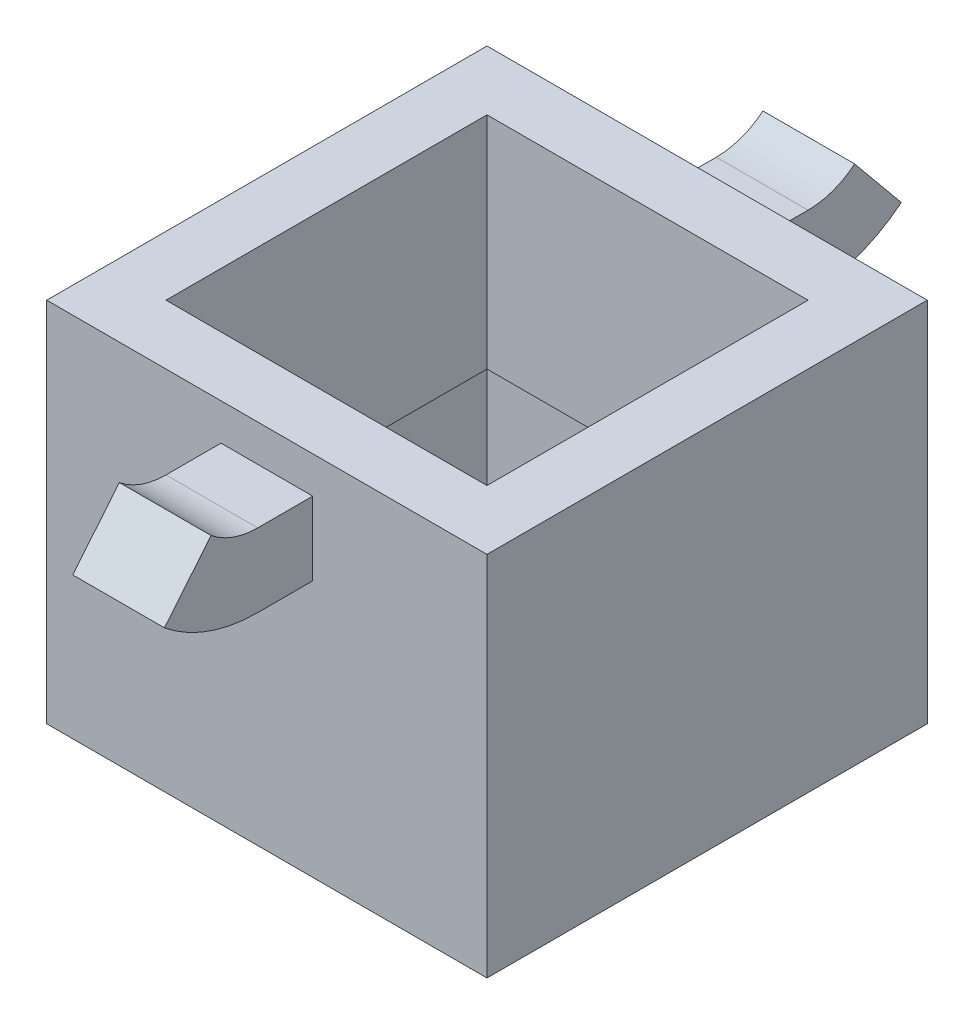
ISO-10303-21;
HEADER;
FILE_DESCRIPTION(('STEP AP214'),'2;1');
FILE_NAME('part.step','',(''),(''),'','','');
FILE_SCHEMA(('AUTOMOTIVE_DESIGN { 1 0 10303 214 1 1 1 1 }'));
ENDSEC;
DATA;
#1=APPLICATION_CONTEXT('core data for automotive mechanical design processes');
#2=APPLICATION_PROTOCOL_DEFINITION('international standard','automotive_design',2000,#1);
#3=PRODUCT_CONTEXT('',#1,'mechanical');
#4=PRODUCT('Part','Part','',(#3));
#5=PRODUCT_RELATED_PRODUCT_CATEGORY('part','',(#4));
#6=PRODUCT_DEFINITION_FORMATION('','',#4);
#7=PRODUCT_DEFINITION_CONTEXT('part definition',#1,'design');
#8=PRODUCT_DEFINITION('design','',#6,#7);
#9=PRODUCT_DEFINITION_SHAPE('','',#8);
#10=(LENGTH_UNIT() NAMED_UNIT(*) SI_UNIT(.MILLI.,.METRE.));
#11=(NAMED_UNIT(*) PLANE_ANGLE_UNIT() SI_UNIT($,.RADIAN.));
#12=(NAMED_UNIT(*) SI_UNIT($,.STERADIAN.) SOLID_ANGLE_UNIT());
#13=UNCERTAINTY_MEASURE_WITH_UNIT(LENGTH_MEASURE(1.E-05),#10,'distance_accuracy_value','');
#14=(GEOMETRIC_REPRESENTATION_CONTEXT(3) GLOBAL_UNCERTAINTY_ASSIGNED_CONTEXT((#13)) GLOBAL_UNIT_ASSIGNED_CONTEXT((#10,
#11,#12)) REPRESENTATION_CONTEXT('',''));
#15=CARTESIAN_POINT('',(0.,0.,0.));
#16=DIRECTION('',(0.,0.,1.));
#17=DIRECTION('',(1.,0.,0.));
#18=AXIS2_PLACEMENT_3D('',#15,#16,#17);
#19=CARTESIAN_POINT('',(12.,20.,-12.));
#20=DIRECTION('',(0.,0.,1.));
#21=DIRECTION('',(1.,0.,0.));
#22=AXIS2_PLACEMENT_3D('',#19,#20,#21);
#23=PLANE('',#22);
#24=DIRECTION('',(-1.,0.,0.));
#25=VECTOR('',#24,1.);
#26=CARTESIAN_POINT('',(12.,0.,-12.));
#27=LINE('',#26,#25);
#28=CARTESIAN_POINT('',(12.,0.,-12.));
#29=VERTEX_POINT('',#28);
#30=CARTESIAN_POINT('',(-12.,0.,-12.));
#31=VERTEX_POINT('',#30);
#32=EDGE_CURVE('E366',#29,#31,#27,.T.);
#33=ORIENTED_EDGE('',*,*,#32,.T.);
#34=DIRECTION('',(0.,-1.,0.));
#35=VECTOR('',#34,1.);
#36=CARTESIAN_POINT('',(-12.,20.,-12.));
#37=LINE('',#36,#35);
#38=CARTESIAN_POINT('',(-12.,20.,-12.));
#39=VERTEX_POINT('',#38);
#40=EDGE_CURVE('E372',#39,#31,#37,.T.);
#41=ORIENTED_EDGE('',*,*,#40,.F.);
#42=DIRECTION('',(-1.,0.,0.));
#43=VECTOR('',#42,1.);
#44=CARTESIAN_POINT('',(12.,20.,-12.));
#45=LINE('',#44,#43);
#46=CARTESIAN_POINT('',(12.,20.,-12.));
#47=VERTEX_POINT('',#46);
#48=EDGE_CURVE('E370',#47,#39,#45,.T.);
#49=ORIENTED_EDGE('',*,*,#48,.F.);
#50=DIRECTION('',(0.,-1.,0.));
#51=VECTOR('',#50,1.);
#52=CARTESIAN_POINT('',(12.,20.,-12.));
#53=LINE('',#52,#51);
#54=EDGE_CURVE('E382',#47,#29,#53,.T.);
#55=ORIENTED_EDGE('',*,*,#54,.T.);
#56=EDGE_LOOP('',(#33,#41,#49,#55));
#57=FACE_BOUND('',#56,.T.);
#58=DIRECTION('',(0.,-1.,0.));
#59=VECTOR('',#58,1.);
#60=CARTESIAN_POINT('',(2.50000000000001,18.,-12.));
#61=LINE('',#60,#59);
#62=CARTESIAN_POINT('',(2.50000000000001,18.,-12.));
#63=VERTEX_POINT('',#62);
#64=CARTESIAN_POINT('',(2.50000000000001,14.,-12.));
#65=VERTEX_POINT('',#64);
#66=EDGE_CURVE('E307',#63,#65,#61,.T.);
#67=ORIENTED_EDGE('',*,*,#66,.F.);
#68=DIRECTION('',(1.,0.,0.));
#69=VECTOR('',#68,1.);
#70=CARTESIAN_POINT('',(-2.49999999999999,18.,-12.));
#71=LINE('',#70,#69);
#72=CARTESIAN_POINT('',(-2.5,18.,-12.));
#73=VERTEX_POINT('',#72);
#74=EDGE_CURVE('E312',#73,#63,#71,.T.);
#75=ORIENTED_EDGE('',*,*,#74,.F.);
#76=DIRECTION('',(0.,1.,0.));
#77=VECTOR('',#76,1.);
#78=CARTESIAN_POINT('',(-2.49999999999999,18.,-12.));
#79=LINE('',#78,#77);
#80=CARTESIAN_POINT('',(-2.5,14.,-12.));
#81=VERTEX_POINT('',#80);
#82=EDGE_CURVE('E321',#81,#73,#79,.T.);
#83=ORIENTED_EDGE('',*,*,#82,.F.);
#84=DIRECTION('',(-1.,0.,0.));
#85=VECTOR('',#84,1.);
#86=CARTESIAN_POINT('',(-2.49999999999999,14.,-12.));
#87=LINE('',#86,#85);
#88=EDGE_CURVE('E318',#65,#81,#87,.T.);
#89=ORIENTED_EDGE('',*,*,#88,.F.);
#90=EDGE_LOOP('',(#67,#75,#83,#89));
#91=FACE_BOUND('',#90,.T.);
#92=ADVANCED_FACE('F33',(#57,#91),#23,.F.);
#93=CARTESIAN_POINT('',(-12.,20.,12.));
#94=DIRECTION('',(1.,0.,0.));
#95=DIRECTION('',(0.,0.,-1.));
#96=AXIS2_PLACEMENT_3D('',#93,#94,#95);
#97=PLANE('',#96);
#98=DIRECTION('',(0.,0.,1.));
#99=VECTOR('',#98,1.);
#100=CARTESIAN_POINT('',(-12.,0.,12.));
#101=LINE('',#100,#99);
#102=CARTESIAN_POINT('',(-12.,0.,12.));
#103=VERTEX_POINT('',#102);
#104=EDGE_CURVE('E361',#31,#103,#101,.T.);
#105=ORIENTED_EDGE('',*,*,#104,.T.);
#106=DIRECTION('',(0.,-1.,0.));
#107=VECTOR('',#106,1.);
#108=CARTESIAN_POINT('',(-12.,20.,12.));
#109=LINE('',#108,#107);
#110=CARTESIAN_POINT('',(-12.,20.,12.));
#111=VERTEX_POINT('',#110);
#112=EDGE_CURVE('E11',#111,#103,#109,.T.);
#113=ORIENTED_EDGE('',*,*,#112,.F.);
#114=DIRECTION('',(0.,0.,1.));
#115=VECTOR('',#114,1.);
#116=CARTESIAN_POINT('',(-12.,20.,12.));
#117=LINE('',#116,#115);
#118=EDGE_CURVE('E362',#39,#111,#117,.T.);
#119=ORIENTED_EDGE('',*,*,#118,.F.);
#120=ORIENTED_EDGE('',*,*,#40,.T.);
#121=EDGE_LOOP('',(#105,#113,#119,#120));
#122=FACE_BOUND('',#121,.T.);
#123=ADVANCED_FACE('F35',(#122),#97,.F.);
#124=CARTESIAN_POINT('',(12.,20.,12.));
#125=DIRECTION('',(0.,0.,-1.));
#126=DIRECTION('',(-1.,0.,0.));
#127=AXIS2_PLACEMENT_3D('',#124,#125,#126);
#128=PLANE('',#127);
#129=DIRECTION('',(1.,0.,0.));
#130=VECTOR('',#129,1.);
#131=CARTESIAN_POINT('',(-2.49999999999999,18.,12.));
#132=LINE('',#131,#130);
#133=CARTESIAN_POINT('',(-2.49999999999999,18.,12.));
#134=VERTEX_POINT('',#133);
#135=CARTESIAN_POINT('',(2.50000000000001,18.,12.));
#136=VERTEX_POINT('',#135);
#137=EDGE_CURVE('E271',#134,#136,#132,.T.);
#138=ORIENTED_EDGE('',*,*,#137,.T.);
#139=DIRECTION('',(0.,-1.,0.));
#140=VECTOR('',#139,1.);
#141=CARTESIAN_POINT('',(2.50000000000001,18.,12.));
#142=LINE('',#141,#140);
#143=CARTESIAN_POINT('',(2.5,14.,12.));
#144=VERTEX_POINT('',#143);
#145=EDGE_CURVE('E254',#136,#144,#142,.T.);
#146=ORIENTED_EDGE('',*,*,#145,.T.);
#147=DIRECTION('',(-1.,0.,0.));
#148=VECTOR('',#147,1.);
#149=CARTESIAN_POINT('',(-2.49999999999999,14.,12.));
#150=LINE('',#149,#148);
#151=CARTESIAN_POINT('',(-2.5,14.,12.));
#152=VERTEX_POINT('',#151);
#153=EDGE_CURVE('E265',#144,#152,#150,.T.);
#154=ORIENTED_EDGE('',*,*,#153,.T.);
#155=DIRECTION('',(0.,1.,0.));
#156=VECTOR('',#155,1.);
#157=CARTESIAN_POINT('',(-2.49999999999999,18.,12.));
#158=LINE('',#157,#156);
#159=EDGE_CURVE('E274',#152,#134,#158,.T.);
#160=ORIENTED_EDGE('',*,*,#159,.T.);
#161=EDGE_LOOP('',(#138,#146,#154,#160));
#162=FACE_BOUND('',#161,.T.);
#163=DIRECTION('',(1.,0.,0.));
#164=VECTOR('',#163,1.);
#165=CARTESIAN_POINT('',(12.,0.,12.));
#166=LINE('',#165,#164);
#167=CARTESIAN_POINT('',(12.,0.,12.));
#168=VERTEX_POINT('',#167);
#169=EDGE_CURVE('E375',#103,#168,#166,.T.);
#170=ORIENTED_EDGE('',*,*,#169,.T.);
#171=DIRECTION('',(0.,-1.,0.));
#172=VECTOR('',#171,1.);
#173=CARTESIAN_POINT('',(12.,20.,12.));
#174=LINE('',#173,#172);
#175=CARTESIAN_POINT('',(12.,20.,12.));
#176=VERTEX_POINT('',#175);
#177=EDGE_CURVE('E41',#176,#168,#174,.T.);
#178=ORIENTED_EDGE('',*,*,#177,.F.);
#179=DIRECTION('',(1.,0.,0.));
#180=VECTOR('',#179,1.);
#181=CARTESIAN_POINT('',(12.,20.,12.));
#182=LINE('',#181,#180);
#183=EDGE_CURVE('E365',#111,#176,#182,.T.);
#184=ORIENTED_EDGE('',*,*,#183,.F.);
#185=ORIENTED_EDGE('',*,*,#112,.T.);
#186=EDGE_LOOP('',(#170,#178,#184,#185));
#187=FACE_BOUND('',#186,.T.);
#188=ADVANCED_FACE('F403',(#162,#187),#128,.F.);
#189=CARTESIAN_POINT('',(12.,20.,12.));
#190=DIRECTION('',(-1.,0.,0.));
#191=DIRECTION('',(0.,0.,1.));
#192=AXIS2_PLACEMENT_3D('',#189,#190,#191);
#193=PLANE('',#192);
#194=DIRECTION('',(0.,0.,-1.));
#195=VECTOR('',#194,1.);
#196=CARTESIAN_POINT('',(12.,0.,12.));
#197=LINE('',#196,#195);
#198=EDGE_CURVE('E377',#168,#29,#197,.T.);
#199=ORIENTED_EDGE('',*,*,#198,.T.);
#200=ORIENTED_EDGE('',*,*,#54,.F.);
#201=DIRECTION('',(0.,0.,-1.));
#202=VECTOR('',#201,1.);
#203=CARTESIAN_POINT('',(12.,20.,12.));
#204=LINE('',#203,#202);
#205=EDGE_CURVE('E368',#176,#47,#204,.T.);
#206=ORIENTED_EDGE('',*,*,#205,.F.);
#207=ORIENTED_EDGE('',*,*,#177,.T.);
#208=EDGE_LOOP('',(#199,#200,#206,#207));
#209=FACE_BOUND('',#208,.T.);
#210=ADVANCED_FACE('F389',(#209),#193,.F.);
#211=CARTESIAN_POINT('',(0.,20.,0.));
#212=DIRECTION('',(0.,1.,0.));
#213=DIRECTION('',(0.,0.,1.));
#214=AXIS2_PLACEMENT_3D('',#211,#212,#213);
#215=PLANE('',#214);
#216=DIRECTION('',(0.,0.,-1.));
#217=VECTOR('',#216,1.);
#218=CARTESIAN_POINT('',(-8.75,20.,-8.75));
#219=LINE('',#218,#217);
#220=CARTESIAN_POINT('',(-8.75,20.,8.75));
#221=VERTEX_POINT('',#220);
#222=CARTESIAN_POINT('',(-8.75,20.,-8.75));
#223=VERTEX_POINT('',#222);
#224=EDGE_CURVE('E204',#221,#223,#219,.T.);
#225=ORIENTED_EDGE('',*,*,#224,.T.);
#226=DIRECTION('',(1.,0.,0.));
#227=VECTOR('',#226,1.);
#228=CARTESIAN_POINT('',(8.75,20.,-8.75));
#229=LINE('',#228,#227);
#230=CARTESIAN_POINT('',(8.75,20.,-8.75));
#231=VERTEX_POINT('',#230);
#232=EDGE_CURVE('E193',#223,#231,#229,.T.);
#233=ORIENTED_EDGE('',*,*,#232,.T.);
#234=DIRECTION('',(0.,0.,1.));
#235=VECTOR('',#234,1.);
#236=CARTESIAN_POINT('',(8.75,20.,-8.75));
#237=LINE('',#236,#235);
#238=CARTESIAN_POINT('',(8.75,20.,8.75));
#239=VERTEX_POINT('',#238);
#240=EDGE_CURVE('E215',#231,#239,#237,.T.);
#241=ORIENTED_EDGE('',*,*,#240,.T.);
#242=DIRECTION('',(-1.,0.,0.));
#243=VECTOR('',#242,1.);
#244=CARTESIAN_POINT('',(8.75,20.,8.75));
#245=LINE('',#244,#243);
#246=EDGE_CURVE('E211',#239,#221,#245,.T.);
#247=ORIENTED_EDGE('',*,*,#246,.T.);
#248=EDGE_LOOP('',(#225,#233,#241,#247));
#249=FACE_BOUND('',#248,.T.);
#250=ORIENTED_EDGE('',*,*,#118,.T.);
#251=ORIENTED_EDGE('',*,*,#183,.T.);
#252=ORIENTED_EDGE('',*,*,#205,.T.);
#253=ORIENTED_EDGE('',*,*,#48,.T.);
#254=EDGE_LOOP('',(#250,#251,#252,#253));
#255=FACE_BOUND('',#254,.T.);
#256=ADVANCED_FACE('F209',(#249,#255),#215,.T.);
#257=CARTESIAN_POINT('',(0.,0.,0.));
#258=DIRECTION('',(0.,1.,0.));
#259=DIRECTION('',(0.,0.,1.));
#260=AXIS2_PLACEMENT_3D('',#257,#258,#259);
#261=PLANE('',#260);
#262=DIRECTION('',(-1.,0.,0.));
#263=VECTOR('',#262,1.);
#264=CARTESIAN_POINT('',(-10.,0.,10.));
#265=LINE('',#264,#263);
#266=CARTESIAN_POINT('',(10.,0.,10.));
#267=VERTEX_POINT('',#266);
#268=CARTESIAN_POINT('',(-10.,0.,10.));
#269=VERTEX_POINT('',#268);
#270=EDGE_CURVE('E242',#267,#269,#265,.T.);
#271=ORIENTED_EDGE('',*,*,#270,.F.);
#272=DIRECTION('',(0.,0.,1.));
#273=VECTOR('',#272,1.);
#274=CARTESIAN_POINT('',(10.,0.,-10.));
#275=LINE('',#274,#273);
#276=CARTESIAN_POINT('',(10.,0.,-10.));
#277=VERTEX_POINT('',#276);
#278=EDGE_CURVE('E240',#277,#267,#275,.T.);
#279=ORIENTED_EDGE('',*,*,#278,.F.);
#280=DIRECTION('',(1.,0.,0.));
#281=VECTOR('',#280,1.);
#282=CARTESIAN_POINT('',(-10.,0.,-10.));
#283=LINE('',#282,#281);
#284=CARTESIAN_POINT('',(-10.,0.,-10.));
#285=VERTEX_POINT('',#284);
#286=EDGE_CURVE('E248',#285,#277,#283,.T.);
#287=ORIENTED_EDGE('',*,*,#286,.F.);
#288=DIRECTION('',(0.,0.,-1.));
#289=VECTOR('',#288,1.);
#290=CARTESIAN_POINT('',(-10.,0.,-10.));
#291=LINE('',#290,#289);
#292=EDGE_CURVE('E245',#269,#285,#291,.T.);
#293=ORIENTED_EDGE('',*,*,#292,.F.);
#294=EDGE_LOOP('',(#271,#279,#287,#293));
#295=FACE_BOUND('',#294,.T.);
#296=ORIENTED_EDGE('',*,*,#104,.F.);
#297=ORIENTED_EDGE('',*,*,#32,.F.);
#298=ORIENTED_EDGE('',*,*,#198,.F.);
#299=ORIENTED_EDGE('',*,*,#169,.F.);
#300=EDGE_LOOP('',(#296,#297,#298,#299));
#301=FACE_BOUND('',#300,.T.);
#302=ADVANCED_FACE('F395',(#295,#301),#261,.F.);
#303=CARTESIAN_POINT('',(0.,22.,-15.));
#304=DIRECTION('',(1.,0.,0.));
#305=DIRECTION('',(0.,0.,-1.));
#306=AXIS2_PLACEMENT_3D('',#303,#304,#305);
#307=CYLINDRICAL_SURFACE('',#306,8.);
#308=DIRECTION('',(-1.,0.,0.));
#309=VECTOR('',#308,1.);
#310=CARTESIAN_POINT('',(-2.49999999999999,14.,-15.));
#311=LINE('',#310,#309);
#312=CARTESIAN_POINT('',(2.5,14.,-15.));
#313=VERTEX_POINT('',#312);
#314=CARTESIAN_POINT('',(-2.49999999999999,14.,-15.));
#315=VERTEX_POINT('',#314);
#316=EDGE_CURVE('E308',#313,#315,#311,.T.);
#317=ORIENTED_EDGE('',*,*,#316,.T.);
#318=CARTESIAN_POINT('',(-2.49999999999999,22.,-15.));
#319=DIRECTION('',(1.,0.,0.));
#320=DIRECTION('',(0.,0.,-1.));
#321=AXIS2_PLACEMENT_3D('',#318,#319,#320);
#322=CIRCLE('',#321,8.);
#323=CARTESIAN_POINT('',(-2.49999999999999,15.8236304445881,-20.0845313564753));
#324=VERTEX_POINT('',#323);
#325=EDGE_CURVE('E355',#315,#324,#322,.T.);
#326=ORIENTED_EDGE('',*,*,#325,.T.);
#327=DIRECTION('',(-1.,0.,0.));
#328=VECTOR('',#327,1.);
#329=CARTESIAN_POINT('',(-2.49999999999999,15.8236304445881,-20.0845313564753));
#330=LINE('',#329,#328);
#331=CARTESIAN_POINT('',(2.5,15.8236304445881,-20.0845313564753));
#332=VERTEX_POINT('',#331);
#333=EDGE_CURVE('E346',#332,#324,#330,.T.);
#334=ORIENTED_EDGE('',*,*,#333,.F.);
#335=CARTESIAN_POINT('',(2.5,22.,-15.));
#336=DIRECTION('',(1.,0.,0.));
#337=DIRECTION('',(0.,0.,-1.));
#338=AXIS2_PLACEMENT_3D('',#335,#336,#337);
#339=CIRCLE('',#338,8.);
#340=EDGE_CURVE('E358',#313,#332,#339,.T.);
#341=ORIENTED_EDGE('',*,*,#340,.F.);
#342=EDGE_LOOP('',(#317,#326,#334,#341));
#343=FACE_BOUND('',#342,.T.);
#344=ADVANCED_FACE('F418',(#343),#307,.T.);
#345=CARTESIAN_POINT('',(0.,22.,-15.));
#346=DIRECTION('',(1.,0.,0.));
#347=DIRECTION('',(0.,0.,-1.));
#348=AXIS2_PLACEMENT_3D('',#345,#346,#347);
#349=CYLINDRICAL_SURFACE('',#348,4.);
#350=DIRECTION('',(1.,0.,0.));
#351=VECTOR('',#350,1.);
#352=CARTESIAN_POINT('',(-2.49999999999999,18.,-15.));
#353=LINE('',#352,#351);
#354=CARTESIAN_POINT('',(-2.49999999999999,18.,-15.));
#355=VERTEX_POINT('',#354);
#356=CARTESIAN_POINT('',(2.50000000000001,18.,-15.));
#357=VERTEX_POINT('',#356);
#358=EDGE_CURVE('E311',#355,#357,#353,.T.);
#359=ORIENTED_EDGE('',*,*,#358,.T.);
#360=CARTESIAN_POINT('',(2.50000000000001,22.,-15.));
#361=DIRECTION('',(1.,0.,0.));
#362=DIRECTION('',(0.,0.,-1.));
#363=AXIS2_PLACEMENT_3D('',#360,#361,#362);
#364=CIRCLE('',#363,4.);
#365=CARTESIAN_POINT('',(2.50000000000001,18.911815222294,-17.5422656782377));
#366=VERTEX_POINT('',#365);
#367=EDGE_CURVE('E349',#357,#366,#364,.T.);
#368=ORIENTED_EDGE('',*,*,#367,.T.);
#369=DIRECTION('',(1.,0.,0.));
#370=VECTOR('',#369,1.);
#371=CARTESIAN_POINT('',(-2.49999999999999,18.911815222294,-17.5422656782377));
#372=LINE('',#371,#370);
#373=CARTESIAN_POINT('',(-2.49999999999999,18.911815222294,-17.5422656782377));
#374=VERTEX_POINT('',#373);
#375=EDGE_CURVE('E340',#374,#366,#372,.T.);
#376=ORIENTED_EDGE('',*,*,#375,.F.);
#377=CARTESIAN_POINT('',(-2.49999999999999,22.,-15.));
#378=DIRECTION('',(1.,0.,0.));
#379=DIRECTION('',(0.,0.,-1.));
#380=AXIS2_PLACEMENT_3D('',#377,#378,#379);
#381=CIRCLE('',#380,4.);
#382=EDGE_CURVE('E352',#355,#374,#381,.T.);
#383=ORIENTED_EDGE('',*,*,#382,.F.);
#384=EDGE_LOOP('',(#359,#368,#376,#383));
#385=FACE_BOUND('',#384,.T.);
#386=ADVANCED_FACE('F424',(#385),#349,.F.);
#387=CARTESIAN_POINT('',(2.50000000000001,18.,-15.));
#388=DIRECTION('',(-1.,0.,0.));
#389=DIRECTION('',(0.,-1.,0.));
#390=AXIS2_PLACEMENT_3D('',#387,#388,#389);
#391=PLANE('',#390);
#392=ORIENTED_EDGE('',*,*,#66,.T.);
#393=DIRECTION('',(0.,0.,1.));
#394=VECTOR('',#393,1.);
#395=CARTESIAN_POINT('',(2.5,14.,-15.));
#396=LINE('',#395,#394);
#397=EDGE_CURVE('E334',#313,#65,#396,.T.);
#398=ORIENTED_EDGE('',*,*,#397,.F.);
#399=ORIENTED_EDGE('',*,*,#340,.T.);
#400=DIRECTION('',(0.,-0.77204619442649,-0.635566419559415));
#401=VECTOR('',#400,1.);
#402=CARTESIAN_POINT('',(2.50000000000001,18.911815222294,-17.5422656782377));
#403=LINE('',#402,#401);
#404=EDGE_CURVE('E337',#366,#332,#403,.T.);
#405=ORIENTED_EDGE('',*,*,#404,.F.);
#406=ORIENTED_EDGE('',*,*,#367,.F.);
#407=DIRECTION('',(0.,0.,1.));
#408=VECTOR('',#407,1.);
#409=CARTESIAN_POINT('',(2.50000000000001,18.,-15.));
#410=LINE('',#409,#408);
#411=EDGE_CURVE('E315',#357,#63,#410,.T.);
#412=ORIENTED_EDGE('',*,*,#411,.T.);
#413=EDGE_LOOP('',(#392,#398,#399,#405,#406,#412));
#414=FACE_BOUND('',#413,.T.);
#415=ADVANCED_FACE('F428',(#414),#391,.F.);
#416=CARTESIAN_POINT('',(-2.49999999999999,14.,-15.));
#417=DIRECTION('',(0.,1.,0.));
#418=DIRECTION('',(0.,0.,1.));
#419=AXIS2_PLACEMENT_3D('',#416,#417,#418);
#420=PLANE('',#419);
#421=ORIENTED_EDGE('',*,*,#88,.T.);
#422=DIRECTION('',(0.,0.,1.));
#423=VECTOR('',#422,1.);
#424=CARTESIAN_POINT('',(-2.49999999999999,14.,-15.));
#425=LINE('',#424,#423);
#426=EDGE_CURVE('E331',#315,#81,#425,.T.);
#427=ORIENTED_EDGE('',*,*,#426,.F.);
#428=ORIENTED_EDGE('',*,*,#316,.F.);
#429=ORIENTED_EDGE('',*,*,#397,.T.);
#430=EDGE_LOOP('',(#421,#427,#428,#429));
#431=FACE_BOUND('',#430,.T.);
#432=ADVANCED_FACE('F432',(#431),#420,.F.);
#433=CARTESIAN_POINT('',(-2.49999999999999,18.,-15.));
#434=DIRECTION('',(1.,0.,0.));
#435=DIRECTION('',(0.,0.,-1.));
#436=AXIS2_PLACEMENT_3D('',#433,#434,#435);
#437=PLANE('',#436);
#438=ORIENTED_EDGE('',*,*,#82,.T.);
#439=DIRECTION('',(0.,0.,1.));
#440=VECTOR('',#439,1.);
#441=CARTESIAN_POINT('',(-2.49999999999999,18.,-15.));
#442=LINE('',#441,#440);
#443=EDGE_CURVE('E328',#355,#73,#442,.T.);
#444=ORIENTED_EDGE('',*,*,#443,.F.);
#445=ORIENTED_EDGE('',*,*,#382,.T.);
#446=DIRECTION('',(0.,0.77204619442649,0.635566419559415));
#447=VECTOR('',#446,1.);
#448=CARTESIAN_POINT('',(-2.49999999999999,18.911815222294,-17.5422656782377));
#449=LINE('',#448,#447);
#450=EDGE_CURVE('E343',#324,#374,#449,.T.);
#451=ORIENTED_EDGE('',*,*,#450,.F.);
#452=ORIENTED_EDGE('',*,*,#325,.F.);
#453=ORIENTED_EDGE('',*,*,#426,.T.);
#454=EDGE_LOOP('',(#438,#444,#445,#451,#452,#453));
#455=FACE_BOUND('',#454,.T.);
#456=ADVANCED_FACE('F436',(#455),#437,.F.);
#457=CARTESIAN_POINT('',(-2.49999999999999,18.,-15.));
#458=DIRECTION('',(0.,-1.,0.));
#459=DIRECTION('',(0.,0.,-1.));
#460=AXIS2_PLACEMENT_3D('',#457,#458,#459);
#461=PLANE('',#460);
#462=ORIENTED_EDGE('',*,*,#74,.T.);
#463=ORIENTED_EDGE('',*,*,#411,.F.);
#464=ORIENTED_EDGE('',*,*,#358,.F.);
#465=ORIENTED_EDGE('',*,*,#443,.T.);
#466=EDGE_LOOP('',(#462,#463,#464,#465));
#467=FACE_BOUND('',#466,.T.);
#468=ADVANCED_FACE('F440',(#467),#461,.F.);
#469=CARTESIAN_POINT('',(0.,5.01498372261722,-28.9824612303071));
#470=DIRECTION('',(0.,-0.635566419559415,0.77204619442649));
#471=DIRECTION('',(1.,0.,0.));
#472=AXIS2_PLACEMENT_3D('',#469,#470,#471);
#473=PLANE('',#472);
#474=ORIENTED_EDGE('',*,*,#404,.T.);
#475=ORIENTED_EDGE('',*,*,#333,.T.);
#476=ORIENTED_EDGE('',*,*,#450,.T.);
#477=ORIENTED_EDGE('',*,*,#375,.T.);
#478=EDGE_LOOP('',(#474,#475,#476,#477));
#479=FACE_BOUND('',#478,.T.);
#480=ADVANCED_FACE('F444',(#479),#473,.F.);
#481=CARTESIAN_POINT('',(0.,22.,15.));
#482=DIRECTION('',(-1.,0.,0.));
#483=DIRECTION('',(0.,0.,1.));
#484=AXIS2_PLACEMENT_3D('',#481,#482,#483);
#485=CYLINDRICAL_SURFACE('',#484,4.);
#486=DIRECTION('',(1.,0.,0.));
#487=VECTOR('',#486,1.);
#488=CARTESIAN_POINT('',(-2.49999999999999,18.,15.));
#489=LINE('',#488,#487);
#490=CARTESIAN_POINT('',(-2.49999999999999,18.,15.));
#491=VERTEX_POINT('',#490);
#492=CARTESIAN_POINT('',(2.50000000000001,18.,15.));
#493=VERTEX_POINT('',#492);
#494=EDGE_CURVE('E261',#491,#493,#489,.T.);
#495=ORIENTED_EDGE('',*,*,#494,.F.);
#496=CARTESIAN_POINT('',(-2.49999999999999,22.,15.));
#497=DIRECTION('',(-1.,0.,0.));
#498=DIRECTION('',(0.,0.,1.));
#499=AXIS2_PLACEMENT_3D('',#496,#497,#498);
#500=CIRCLE('',#499,4.);
#501=CARTESIAN_POINT('',(-2.49999999999999,18.911815222294,17.5422656782377));
#502=VERTEX_POINT('',#501);
#503=EDGE_CURVE('E301',#491,#502,#500,.T.);
#504=ORIENTED_EDGE('',*,*,#503,.T.);
#505=DIRECTION('',(1.,0.,0.));
#506=VECTOR('',#505,1.);
#507=CARTESIAN_POINT('',(-2.49999999999999,18.911815222294,17.5422656782377));
#508=LINE('',#507,#506);
#509=CARTESIAN_POINT('',(2.50000000000001,18.911815222294,17.5422656782377));
#510=VERTEX_POINT('',#509);
#511=EDGE_CURVE('E293',#502,#510,#508,.T.);
#512=ORIENTED_EDGE('',*,*,#511,.T.);
#513=CARTESIAN_POINT('',(2.50000000000001,22.,15.));
#514=DIRECTION('',(-1.,0.,0.));
#515=DIRECTION('',(0.,0.,1.));
#516=AXIS2_PLACEMENT_3D('',#513,#514,#515);
#517=CIRCLE('',#516,4.);
#518=EDGE_CURVE('E304',#493,#510,#517,.T.);
#519=ORIENTED_EDGE('',*,*,#518,.F.);
#520=EDGE_LOOP('',(#495,#504,#512,#519));
#521=FACE_BOUND('',#520,.T.);
#522=ADVANCED_FACE('F448',(#521),#485,.F.);
#523=CARTESIAN_POINT('',(0.,22.,15.));
#524=DIRECTION('',(-1.,0.,0.));
#525=DIRECTION('',(0.,0.,1.));
#526=AXIS2_PLACEMENT_3D('',#523,#524,#525);
#527=CYLINDRICAL_SURFACE('',#526,8.);
#528=DIRECTION('',(-1.,0.,0.));
#529=VECTOR('',#528,1.);
#530=CARTESIAN_POINT('',(-2.49999999999999,14.,15.));
#531=LINE('',#530,#529);
#532=CARTESIAN_POINT('',(2.5,14.,15.));
#533=VERTEX_POINT('',#532);
#534=CARTESIAN_POINT('',(-2.49999999999999,14.,15.));
#535=VERTEX_POINT('',#534);
#536=EDGE_CURVE('E264',#533,#535,#531,.T.);
#537=ORIENTED_EDGE('',*,*,#536,.F.);
#538=CARTESIAN_POINT('',(2.5,22.,15.));
#539=DIRECTION('',(-1.,0.,0.));
#540=DIRECTION('',(0.,0.,1.));
#541=AXIS2_PLACEMENT_3D('',#538,#539,#540);
#542=CIRCLE('',#541,8.);
#543=CARTESIAN_POINT('',(2.5,15.8236304445881,20.0845313564753));
#544=VERTEX_POINT('',#543);
#545=EDGE_CURVE('E295',#533,#544,#542,.T.);
#546=ORIENTED_EDGE('',*,*,#545,.T.);
#547=DIRECTION('',(-1.,0.,0.));
#548=VECTOR('',#547,1.);
#549=CARTESIAN_POINT('',(-2.49999999999999,15.8236304445881,20.0845313564753));
#550=LINE('',#549,#548);
#551=CARTESIAN_POINT('',(-2.49999999999999,15.8236304445881,20.0845313564753));
#552=VERTEX_POINT('',#551);
#553=EDGE_CURVE('E289',#544,#552,#550,.T.);
#554=ORIENTED_EDGE('',*,*,#553,.T.);
#555=CARTESIAN_POINT('',(-2.49999999999999,22.,15.));
#556=DIRECTION('',(-1.,0.,0.));
#557=DIRECTION('',(0.,0.,1.));
#558=AXIS2_PLACEMENT_3D('',#555,#556,#557);
#559=CIRCLE('',#558,8.);
#560=EDGE_CURVE('E298',#535,#552,#559,.T.);
#561=ORIENTED_EDGE('',*,*,#560,.F.);
#562=EDGE_LOOP('',(#537,#546,#554,#561));
#563=FACE_BOUND('',#562,.T.);
#564=ADVANCED_FACE('F452',(#563),#527,.T.);
#565=CARTESIAN_POINT('',(2.50000000000001,18.,15.));
#566=DIRECTION('',(1.,0.,0.));
#567=DIRECTION('',(0.,1.,0.));
#568=AXIS2_PLACEMENT_3D('',#565,#566,#567);
#569=PLANE('',#568);
#570=ORIENTED_EDGE('',*,*,#145,.F.);
#571=DIRECTION('',(0.,0.,-1.));
#572=VECTOR('',#571,1.);
#573=CARTESIAN_POINT('',(2.50000000000001,18.,15.));
#574=LINE('',#573,#572);
#575=EDGE_CURVE('E285',#493,#136,#574,.T.);
#576=ORIENTED_EDGE('',*,*,#575,.F.);
#577=ORIENTED_EDGE('',*,*,#518,.T.);
#578=DIRECTION('',(0.,-0.77204619442649,0.635566419559415));
#579=VECTOR('',#578,1.);
#580=CARTESIAN_POINT('',(2.50000000000001,18.911815222294,17.5422656782377));
#581=LINE('',#580,#579);
#582=EDGE_CURVE('E287',#510,#544,#581,.T.);
#583=ORIENTED_EDGE('',*,*,#582,.T.);
#584=ORIENTED_EDGE('',*,*,#545,.F.);
#585=DIRECTION('',(0.,0.,-1.));
#586=VECTOR('',#585,1.);
#587=CARTESIAN_POINT('',(2.5,14.,15.));
#588=LINE('',#587,#586);
#589=EDGE_CURVE('E268',#533,#144,#588,.T.);
#590=ORIENTED_EDGE('',*,*,#589,.T.);
#591=EDGE_LOOP('',(#570,#576,#577,#583,#584,#590));
#592=FACE_BOUND('',#591,.T.);
#593=ADVANCED_FACE('F456',(#592),#569,.T.);
#594=CARTESIAN_POINT('',(-2.49999999999999,18.,15.));
#595=DIRECTION('',(0.,1.,0.));
#596=DIRECTION('',(0.,0.,1.));
#597=AXIS2_PLACEMENT_3D('',#594,#595,#596);
#598=PLANE('',#597);
#599=ORIENTED_EDGE('',*,*,#137,.F.);
#600=DIRECTION('',(0.,0.,-1.));
#601=VECTOR('',#600,1.);
#602=CARTESIAN_POINT('',(-2.49999999999999,18.,15.));
#603=LINE('',#602,#601);
#604=EDGE_CURVE('E283',#491,#134,#603,.T.);
#605=ORIENTED_EDGE('',*,*,#604,.F.);
#606=ORIENTED_EDGE('',*,*,#494,.T.);
#607=ORIENTED_EDGE('',*,*,#575,.T.);
#608=EDGE_LOOP('',(#599,#605,#606,#607));
#609=FACE_BOUND('',#608,.T.);
#610=ADVANCED_FACE('F460',(#609),#598,.T.);
#611=CARTESIAN_POINT('',(-2.49999999999999,18.,15.));
#612=DIRECTION('',(-1.,0.,0.));
#613=DIRECTION('',(0.,0.,1.));
#614=AXIS2_PLACEMENT_3D('',#611,#612,#613);
#615=PLANE('',#614);
#616=ORIENTED_EDGE('',*,*,#159,.F.);
#617=DIRECTION('',(0.,0.,-1.));
#618=VECTOR('',#617,1.);
#619=CARTESIAN_POINT('',(-2.49999999999999,14.,15.));
#620=LINE('',#619,#618);
#621=EDGE_CURVE('E280',#535,#152,#620,.T.);
#622=ORIENTED_EDGE('',*,*,#621,.F.);
#623=ORIENTED_EDGE('',*,*,#560,.T.);
#624=DIRECTION('',(0.,0.77204619442649,-0.635566419559415));
#625=VECTOR('',#624,1.);
#626=CARTESIAN_POINT('',(-2.49999999999999,18.911815222294,17.5422656782377));
#627=LINE('',#626,#625);
#628=EDGE_CURVE('E291',#552,#502,#627,.T.);
#629=ORIENTED_EDGE('',*,*,#628,.T.);
#630=ORIENTED_EDGE('',*,*,#503,.F.);
#631=ORIENTED_EDGE('',*,*,#604,.T.);
#632=EDGE_LOOP('',(#616,#622,#623,#629,#630,#631));
#633=FACE_BOUND('',#632,.T.);
#634=ADVANCED_FACE('F464',(#633),#615,.T.);
#635=CARTESIAN_POINT('',(-2.49999999999999,14.,15.));
#636=DIRECTION('',(0.,-1.,0.));
#637=DIRECTION('',(0.,0.,-1.));
#638=AXIS2_PLACEMENT_3D('',#635,#636,#637);
#639=PLANE('',#638);
#640=ORIENTED_EDGE('',*,*,#153,.F.);
#641=ORIENTED_EDGE('',*,*,#589,.F.);
#642=ORIENTED_EDGE('',*,*,#536,.T.);
#643=ORIENTED_EDGE('',*,*,#621,.T.);
#644=EDGE_LOOP('',(#640,#641,#642,#643));
#645=FACE_BOUND('',#644,.T.);
#646=ADVANCED_FACE('F468',(#645),#639,.T.);
#647=CARTESIAN_POINT('',(0.,5.01498372261722,28.9824612303071));
#648=DIRECTION('',(0.,-0.635566419559415,-0.77204619442649));
#649=DIRECTION('',(1.,0.,0.));
#650=AXIS2_PLACEMENT_3D('',#647,#648,#649);
#651=PLANE('',#650);
#652=ORIENTED_EDGE('',*,*,#582,.F.);
#653=ORIENTED_EDGE('',*,*,#511,.F.);
#654=ORIENTED_EDGE('',*,*,#628,.F.);
#655=ORIENTED_EDGE('',*,*,#553,.F.);
#656=EDGE_LOOP('',(#652,#653,#654,#655));
#657=FACE_BOUND('',#656,.T.);
#658=ADVANCED_FACE('F472',(#657),#651,.F.);
#659=CARTESIAN_POINT('',(10.,6.,-10.));
#660=DIRECTION('',(1.,0.,0.));
#661=DIRECTION('',(0.,0.,-1.));
#662=AXIS2_PLACEMENT_3D('',#659,#660,#661);
#663=PLANE('',#662);
#664=ORIENTED_EDGE('',*,*,#278,.T.);
#665=DIRECTION('',(0.,-1.,0.));
#666=VECTOR('',#665,1.);
#667=CARTESIAN_POINT('',(10.,6.,10.));
#668=LINE('',#667,#666);
#669=CARTESIAN_POINT('',(10.,8.,10.));
#670=VERTEX_POINT('',#669);
#671=EDGE_CURVE('E251',#670,#267,#668,.T.);
#672=ORIENTED_EDGE('',*,*,#671,.F.);
#673=DIRECTION('',(0.,0.,1.));
#674=VECTOR('',#673,1.);
#675=CARTESIAN_POINT('',(10.,8.,10.));
#676=LINE('',#675,#674);
#677=CARTESIAN_POINT('',(10.,8.,-10.));
#678=VERTEX_POINT('',#677);
#679=EDGE_CURVE('E234',#678,#670,#676,.T.);
#680=ORIENTED_EDGE('',*,*,#679,.F.);
#681=DIRECTION('',(0.,-1.,0.));
#682=VECTOR('',#681,1.);
#683=CARTESIAN_POINT('',(10.,6.,-10.));
#684=LINE('',#683,#682);
#685=EDGE_CURVE('E252',#678,#277,#684,.T.);
#686=ORIENTED_EDGE('',*,*,#685,.T.);
#687=EDGE_LOOP('',(#664,#672,#680,#686));
#688=FACE_BOUND('',#687,.T.);
#689=ADVANCED_FACE('F476',(#688),#663,.F.);
#690=CARTESIAN_POINT('',(-10.,6.,-10.));
#691=DIRECTION('',(0.,0.,-1.));
#692=DIRECTION('',(-1.,0.,0.));
#693=AXIS2_PLACEMENT_3D('',#690,#691,#692);
#694=PLANE('',#693);
#695=ORIENTED_EDGE('',*,*,#286,.T.);
#696=ORIENTED_EDGE('',*,*,#685,.F.);
#697=DIRECTION('',(1.,0.,0.));
#698=VECTOR('',#697,1.);
#699=CARTESIAN_POINT('',(10.,8.,-10.));
#700=LINE('',#699,#698);
#701=CARTESIAN_POINT('',(-10.,8.,-10.));
#702=VERTEX_POINT('',#701);
#703=EDGE_CURVE('E231',#702,#678,#700,.T.);
#704=ORIENTED_EDGE('',*,*,#703,.F.);
#705=DIRECTION('',(0.,-1.,0.));
#706=VECTOR('',#705,1.);
#707=CARTESIAN_POINT('',(-10.,6.,-10.));
#708=LINE('',#707,#706);
#709=EDGE_CURVE('E255',#702,#285,#708,.T.);
#710=ORIENTED_EDGE('',*,*,#709,.T.);
#711=EDGE_LOOP('',(#695,#696,#704,#710));
#712=FACE_BOUND('',#711,.T.);
#713=ADVANCED_FACE('F480',(#712),#694,.F.);
#714=CARTESIAN_POINT('',(-10.,6.,-10.));
#715=DIRECTION('',(-1.,0.,0.));
#716=DIRECTION('',(0.,0.,1.));
#717=AXIS2_PLACEMENT_3D('',#714,#715,#716);
#718=PLANE('',#717);
#719=ORIENTED_EDGE('',*,*,#292,.T.);
#720=ORIENTED_EDGE('',*,*,#709,.F.);
#721=DIRECTION('',(0.,0.,-1.));
#722=VECTOR('',#721,1.);
#723=CARTESIAN_POINT('',(-10.,8.,10.));
#724=LINE('',#723,#722);
#725=CARTESIAN_POINT('',(-10.,8.,10.));
#726=VERTEX_POINT('',#725);
#727=EDGE_CURVE('E200',#726,#702,#724,.T.);
#728=ORIENTED_EDGE('',*,*,#727,.F.);
#729=DIRECTION('',(0.,-1.,0.));
#730=VECTOR('',#729,1.);
#731=CARTESIAN_POINT('',(-10.,6.,10.));
#732=LINE('',#731,#730);
#733=EDGE_CURVE('E257',#726,#269,#732,.T.);
#734=ORIENTED_EDGE('',*,*,#733,.T.);
#735=EDGE_LOOP('',(#719,#720,#728,#734));
#736=FACE_BOUND('',#735,.T.);
#737=ADVANCED_FACE('F486',(#736),#718,.F.);
#738=CARTESIAN_POINT('',(-10.,6.,10.));
#739=DIRECTION('',(0.,0.,1.));
#740=DIRECTION('',(1.,0.,0.));
#741=AXIS2_PLACEMENT_3D('',#738,#739,#740);
#742=PLANE('',#741);
#743=ORIENTED_EDGE('',*,*,#270,.T.);
#744=ORIENTED_EDGE('',*,*,#733,.F.);
#745=DIRECTION('',(-1.,0.,0.));
#746=VECTOR('',#745,1.);
#747=CARTESIAN_POINT('',(10.,8.,10.));
#748=LINE('',#747,#746);
#749=EDGE_CURVE('E237',#670,#726,#748,.T.);
#750=ORIENTED_EDGE('',*,*,#749,.F.);
#751=ORIENTED_EDGE('',*,*,#671,.T.);
#752=EDGE_LOOP('',(#743,#744,#750,#751));
#753=FACE_BOUND('',#752,.T.);
#754=ADVANCED_FACE('F482',(#753),#742,.F.);
#755=CARTESIAN_POINT('',(0.,8.,0.));
#756=DIRECTION('',(0.,1.,0.));
#757=DIRECTION('',(0.,0.,1.));
#758=AXIS2_PLACEMENT_3D('',#755,#756,#757);
#759=PLANE('',#758);
#760=DIRECTION('',(1.,0.,0.));
#761=VECTOR('',#760,1.);
#762=CARTESIAN_POINT('',(8.75,8.,-8.75));
#763=LINE('',#762,#761);
#764=CARTESIAN_POINT('',(-8.75,8.,-8.75));
#765=VERTEX_POINT('',#764);
#766=CARTESIAN_POINT('',(8.75,8.,-8.75));
#767=VERTEX_POINT('',#766);
#768=EDGE_CURVE('E213',#765,#767,#763,.T.);
#769=ORIENTED_EDGE('',*,*,#768,.F.);
#770=DIRECTION('',(0.,0.,-1.));
#771=VECTOR('',#770,1.);
#772=CARTESIAN_POINT('',(-8.75,8.,-8.75));
#773=LINE('',#772,#771);
#774=CARTESIAN_POINT('',(-8.75,8.,8.75));
#775=VERTEX_POINT('',#774);
#776=EDGE_CURVE('E56',#775,#765,#773,.T.);
#777=ORIENTED_EDGE('',*,*,#776,.F.);
#778=DIRECTION('',(-1.,0.,0.));
#779=VECTOR('',#778,1.);
#780=CARTESIAN_POINT('',(8.75,8.,8.75));
#781=LINE('',#780,#779);
#782=CARTESIAN_POINT('',(8.75,8.,8.75));
#783=VERTEX_POINT('',#782);
#784=EDGE_CURVE('E206',#783,#775,#781,.T.);
#785=ORIENTED_EDGE('',*,*,#784,.F.);
#786=DIRECTION('',(0.,0.,1.));
#787=VECTOR('',#786,1.);
#788=CARTESIAN_POINT('',(8.75,8.,-8.75));
#789=LINE('',#788,#787);
#790=EDGE_CURVE('E220',#767,#783,#789,.T.);
#791=ORIENTED_EDGE('',*,*,#790,.F.);
#792=EDGE_LOOP('',(#769,#777,#785,#791));
#793=FACE_BOUND('',#792,.T.);
#794=ORIENTED_EDGE('',*,*,#727,.T.);
#795=ORIENTED_EDGE('',*,*,#703,.T.);
#796=ORIENTED_EDGE('',*,*,#679,.T.);
#797=ORIENTED_EDGE('',*,*,#749,.T.);
#798=EDGE_LOOP('',(#794,#795,#796,#797));
#799=FACE_BOUND('',#798,.T.);
#800=ADVANCED_FACE('F485',(#793,#799),#759,.F.);
#801=CARTESIAN_POINT('',(-8.75,20.001,-8.75));
#802=DIRECTION('',(-1.,0.,0.));
#803=DIRECTION('',(0.,0.,1.));
#804=AXIS2_PLACEMENT_3D('',#801,#802,#803);
#805=PLANE('',#804);
#806=DIRECTION('',(0.,-1.,0.));
#807=VECTOR('',#806,1.);
#808=CARTESIAN_POINT('',(-8.75,20.001,8.75));
#809=LINE('',#808,#807);
#810=EDGE_CURVE('E201',#221,#775,#809,.T.);
#811=ORIENTED_EDGE('',*,*,#810,.T.);
#812=ORIENTED_EDGE('',*,*,#776,.T.);
#813=DIRECTION('',(0.,-1.,0.));
#814=VECTOR('',#813,1.);
#815=CARTESIAN_POINT('',(-8.75,20.001,-8.75));
#816=LINE('',#815,#814);
#817=EDGE_CURVE('E195',#223,#765,#816,.T.);
#818=ORIENTED_EDGE('',*,*,#817,.F.);
#819=ORIENTED_EDGE('',*,*,#224,.F.);
#820=EDGE_LOOP('',(#811,#812,#818,#819));
#821=FACE_BOUND('',#820,.T.);
#822=ADVANCED_FACE('F203',(#821),#805,.F.);
#823=CARTESIAN_POINT('',(8.75,20.001,8.75));
#824=DIRECTION('',(0.,0.,1.));
#825=DIRECTION('',(1.,0.,0.));
#826=AXIS2_PLACEMENT_3D('',#823,#824,#825);
#827=PLANE('',#826);
#828=DIRECTION('',(0.,-1.,0.));
#829=VECTOR('',#828,1.);
#830=CARTESIAN_POINT('',(8.75,20.001,8.75));
#831=LINE('',#830,#829);
#832=EDGE_CURVE('E226',#239,#783,#831,.T.);
#833=ORIENTED_EDGE('',*,*,#832,.T.);
#834=ORIENTED_EDGE('',*,*,#784,.T.);
#835=ORIENTED_EDGE('',*,*,#810,.F.);
#836=ORIENTED_EDGE('',*,*,#246,.F.);
#837=EDGE_LOOP('',(#833,#834,#835,#836));
#838=FACE_BOUND('',#837,.T.);
#839=ADVANCED_FACE('F499',(#838),#827,.F.);
#840=CARTESIAN_POINT('',(8.75,20.001,-8.75));
#841=DIRECTION('',(1.,0.,0.));
#842=DIRECTION('',(0.,0.,-1.));
#843=AXIS2_PLACEMENT_3D('',#840,#841,#842);
#844=PLANE('',#843);
#845=DIRECTION('',(0.,-1.,0.));
#846=VECTOR('',#845,1.);
#847=CARTESIAN_POINT('',(8.75,20.001,-8.75));
#848=LINE('',#847,#846);
#849=EDGE_CURVE('E48',#231,#767,#848,.T.);
#850=ORIENTED_EDGE('',*,*,#849,.T.);
#851=ORIENTED_EDGE('',*,*,#790,.T.);
#852=ORIENTED_EDGE('',*,*,#832,.F.);
#853=ORIENTED_EDGE('',*,*,#240,.F.);
#854=EDGE_LOOP('',(#850,#851,#852,#853));
#855=FACE_BOUND('',#854,.T.);
#856=ADVANCED_FACE('F502',(#855),#844,.F.);
#857=CARTESIAN_POINT('',(8.75,20.001,-8.75));
#858=DIRECTION('',(0.,0.,-1.));
#859=DIRECTION('',(-1.,0.,0.));
#860=AXIS2_PLACEMENT_3D('',#857,#858,#859);
#861=PLANE('',#860);
#862=ORIENTED_EDGE('',*,*,#817,.T.);
#863=ORIENTED_EDGE('',*,*,#768,.T.);
#864=ORIENTED_EDGE('',*,*,#849,.F.);
#865=ORIENTED_EDGE('',*,*,#232,.F.);
#866=EDGE_LOOP('',(#862,#863,#864,#865));
#867=FACE_BOUND('',#866,.T.);
#868=ADVANCED_FACE('F194',(#867),#861,.F.);
#869=CLOSED_SHELL('',(#92,#123,#188,#210,#256,#302,#344,#386,#415,#432,#456,#468,#480,#522,#564,
#593,#610,#634,#646,#658,#689,#713,#737,#754,#800,#822,#839,#856,#868));
#870=MANIFOLD_SOLID_BREP('B2',#869);
#871=ADVANCED_BREP_SHAPE_REPRESENTATION('',(#18,#870),#14);
#872=SHAPE_DEFINITION_REPRESENTATION(#9,#871);
ENDSEC;
END-ISO-10303-21;
